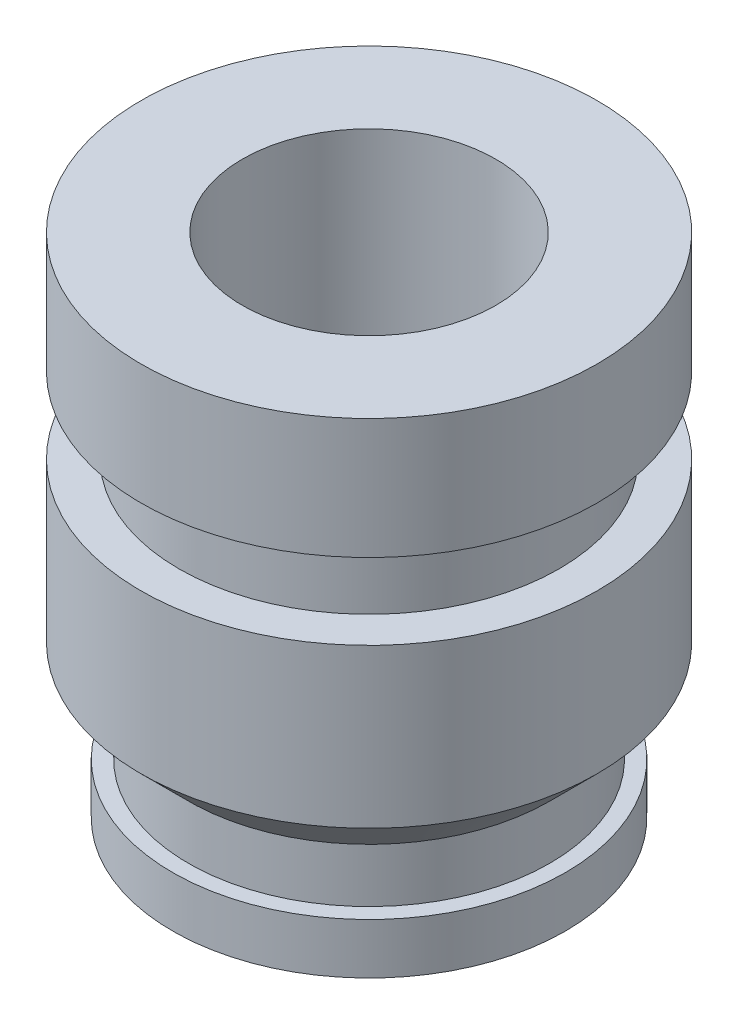
ISO-10303-21;
HEADER;
FILE_DESCRIPTION(('STEP AP214'),'2;1');
FILE_NAME('part.step','',(''),(''),'','','');
FILE_SCHEMA(('AUTOMOTIVE_DESIGN { 1 0 10303 214 1 1 1 1 }'));
ENDSEC;
DATA;
#1=APPLICATION_CONTEXT('core data for automotive mechanical design processes');
#2=APPLICATION_PROTOCOL_DEFINITION('international standard','automotive_design',2000,#1);
#3=PRODUCT_CONTEXT('',#1,'mechanical');
#4=PRODUCT('Part','Part','',(#3));
#5=PRODUCT_RELATED_PRODUCT_CATEGORY('part','',(#4));
#6=PRODUCT_DEFINITION_FORMATION('','',#4);
#7=PRODUCT_DEFINITION_CONTEXT('part definition',#1,'design');
#8=PRODUCT_DEFINITION('design','',#6,#7);
#9=PRODUCT_DEFINITION_SHAPE('','',#8);
#10=(LENGTH_UNIT() NAMED_UNIT(*) SI_UNIT(.MILLI.,.METRE.));
#11=(NAMED_UNIT(*) PLANE_ANGLE_UNIT() SI_UNIT($,.RADIAN.));
#12=(NAMED_UNIT(*) SI_UNIT($,.STERADIAN.) SOLID_ANGLE_UNIT());
#13=UNCERTAINTY_MEASURE_WITH_UNIT(LENGTH_MEASURE(1.E-05),#10,'distance_accuracy_value','');
#14=(GEOMETRIC_REPRESENTATION_CONTEXT(3) GLOBAL_UNCERTAINTY_ASSIGNED_CONTEXT((#13)) GLOBAL_UNIT_ASSIGNED_CONTEXT((#10,
#11,#12)) REPRESENTATION_CONTEXT('',''));
#15=CARTESIAN_POINT('',(0.,0.,0.));
#16=DIRECTION('',(0.,0.,1.));
#17=DIRECTION('',(1.,0.,0.));
#18=AXIS2_PLACEMENT_3D('',#15,#16,#17);
#19=CARTESIAN_POINT('',(1.55,0.,0.));
#20=DIRECTION('',(0.,-1.,0.));
#21=DIRECTION('',(1.,0.,0.));
#22=AXIS2_PLACEMENT_3D('',#19,#20,#21);
#23=PLANE('',#22);
#24=CARTESIAN_POINT('',(0.,0.,0.));
#25=DIRECTION('',(0.,-1.,0.));
#26=DIRECTION('',(1.,0.,0.));
#27=AXIS2_PLACEMENT_3D('',#24,#25,#26);
#28=CIRCLE('',#27,1.55);
#29=CARTESIAN_POINT('',(1.55,0.,0.));
#30=VERTEX_POINT('',#29);
#31=EDGE_CURVE('E92',#30,#30,#28,.T.);
#32=ORIENTED_EDGE('',*,*,#31,.T.);
#33=EDGE_LOOP('',(#32));
#34=FACE_BOUND('',#33,.T.);
#35=CARTESIAN_POINT('',(0.,0.,0.));
#36=DIRECTION('',(0.,-1.,0.));
#37=DIRECTION('',(1.,0.,0.));
#38=AXIS2_PLACEMENT_3D('',#35,#36,#37);
#39=CIRCLE('',#38,1.);
#40=CARTESIAN_POINT('',(1.,0.,0.));
#41=VERTEX_POINT('',#40);
#42=EDGE_CURVE('E10',#41,#41,#39,.T.);
#43=ORIENTED_EDGE('',*,*,#42,.F.);
#44=EDGE_LOOP('',(#43));
#45=FACE_BOUND('',#44,.T.);
#46=ADVANCED_FACE('F41',(#34,#45),#23,.T.);
#47=CARTESIAN_POINT('',(3.43024899888577E-12,-1000.,0.));
#48=DIRECTION('',(0.,-1.,0.));
#49=DIRECTION('',(1.,0.,0.));
#50=AXIS2_PLACEMENT_3D('',#47,#48,#49);
#51=CYLINDRICAL_SURFACE('',#50,1.00000000000001);
#52=ORIENTED_EDGE('',*,*,#42,.T.);
#53=EDGE_LOOP('',(#52));
#54=FACE_BOUND('',#53,.T.);
#55=CARTESIAN_POINT('',(0.,4.,0.));
#56=DIRECTION('',(0.,-1.,0.));
#57=DIRECTION('',(1.,0.,0.));
#58=AXIS2_PLACEMENT_3D('',#55,#56,#57);
#59=CIRCLE('',#58,1.00000000000001);
#60=CARTESIAN_POINT('',(1.,4.00000000000001,0.));
#61=VERTEX_POINT('',#60);
#62=EDGE_CURVE('E48',#61,#61,#59,.T.);
#63=ORIENTED_EDGE('',*,*,#62,.F.);
#64=EDGE_LOOP('',(#63));
#65=FACE_BOUND('',#64,.T.);
#66=ADVANCED_FACE('F111',(#54,#65),#51,.F.);
#67=CARTESIAN_POINT('',(1.,4.,0.));
#68=DIRECTION('',(0.,1.,0.));
#69=DIRECTION('',(-1.,0.,0.));
#70=AXIS2_PLACEMENT_3D('',#67,#68,#69);
#71=PLANE('',#70);
#72=ORIENTED_EDGE('',*,*,#62,.T.);
#73=EDGE_LOOP('',(#72));
#74=FACE_BOUND('',#73,.T.);
#75=CARTESIAN_POINT('',(0.,4.,0.));
#76=DIRECTION('',(0.,-1.,0.));
#77=DIRECTION('',(1.,0.,0.));
#78=AXIS2_PLACEMENT_3D('',#75,#76,#77);
#79=CIRCLE('',#78,1.80000000000001);
#80=CARTESIAN_POINT('',(1.8,4.00000000000001,0.));
#81=VERTEX_POINT('',#80);
#82=EDGE_CURVE('E53',#81,#81,#79,.T.);
#83=ORIENTED_EDGE('',*,*,#82,.F.);
#84=EDGE_LOOP('',(#83));
#85=FACE_BOUND('',#84,.T.);
#86=ADVANCED_FACE('F115',(#74,#85),#71,.T.);
#87=CARTESIAN_POINT('',(3.43024899888577E-12,-1000.,0.));
#88=DIRECTION('',(0.,-1.,0.));
#89=DIRECTION('',(1.,0.,0.));
#90=AXIS2_PLACEMENT_3D('',#87,#88,#89);
#91=CYLINDRICAL_SURFACE('',#90,1.80000000000001);
#92=ORIENTED_EDGE('',*,*,#82,.T.);
#93=EDGE_LOOP('',(#92));
#94=FACE_BOUND('',#93,.T.);
#95=CARTESIAN_POINT('',(0.,3.05,0.));
#96=DIRECTION('',(0.,-1.,0.));
#97=DIRECTION('',(1.,0.,0.));
#98=AXIS2_PLACEMENT_3D('',#95,#96,#97);
#99=CIRCLE('',#98,1.80000000000001);
#100=CARTESIAN_POINT('',(1.8,3.05,0.));
#101=VERTEX_POINT('',#100);
#102=EDGE_CURVE('E58',#101,#101,#99,.T.);
#103=ORIENTED_EDGE('',*,*,#102,.F.);
#104=EDGE_LOOP('',(#103));
#105=FACE_BOUND('',#104,.T.);
#106=ADVANCED_FACE('F119',(#94,#105),#91,.T.);
#107=CARTESIAN_POINT('',(1.8,3.05,0.));
#108=DIRECTION('',(0.,-1.,0.));
#109=DIRECTION('',(1.,0.,0.));
#110=AXIS2_PLACEMENT_3D('',#107,#108,#109);
#111=PLANE('',#110);
#112=ORIENTED_EDGE('',*,*,#102,.T.);
#113=EDGE_LOOP('',(#112));
#114=FACE_BOUND('',#113,.T.);
#115=CARTESIAN_POINT('',(0.,3.05,0.));
#116=DIRECTION('',(0.,-1.,0.));
#117=DIRECTION('',(1.,0.,0.));
#118=AXIS2_PLACEMENT_3D('',#115,#116,#117);
#119=CIRCLE('',#118,1.50000000000001);
#120=CARTESIAN_POINT('',(1.5,3.05,0.));
#121=VERTEX_POINT('',#120);
#122=EDGE_CURVE('E64',#121,#121,#119,.T.);
#123=ORIENTED_EDGE('',*,*,#122,.F.);
#124=EDGE_LOOP('',(#123));
#125=FACE_BOUND('',#124,.T.);
#126=ADVANCED_FACE('F125',(#114,#125),#111,.T.);
#127=CARTESIAN_POINT('',(3.43024899888577E-12,-1000.,0.));
#128=DIRECTION('',(0.,-1.,0.));
#129=DIRECTION('',(1.,0.,0.));
#130=AXIS2_PLACEMENT_3D('',#127,#128,#129);
#131=CYLINDRICAL_SURFACE('',#130,1.50000000000001);
#132=ORIENTED_EDGE('',*,*,#122,.T.);
#133=EDGE_LOOP('',(#132));
#134=FACE_BOUND('',#133,.T.);
#135=CARTESIAN_POINT('',(0.,2.45000000000006,0.));
#136=DIRECTION('',(0.,-1.,0.));
#137=DIRECTION('',(1.,0.,0.));
#138=AXIS2_PLACEMENT_3D('',#135,#136,#137);
#139=CIRCLE('',#138,1.50000000000001);
#140=CARTESIAN_POINT('',(1.5,2.45000000000007,0.));
#141=VERTEX_POINT('',#140);
#142=EDGE_CURVE('E68',#141,#141,#139,.T.);
#143=ORIENTED_EDGE('',*,*,#142,.F.);
#144=EDGE_LOOP('',(#143));
#145=FACE_BOUND('',#144,.T.);
#146=ADVANCED_FACE('F129',(#134,#145),#131,.T.);
#147=CARTESIAN_POINT('',(1.5,2.45,0.));
#148=DIRECTION('',(0.,1.,0.));
#149=DIRECTION('',(-1.,0.,0.));
#150=AXIS2_PLACEMENT_3D('',#147,#148,#149);
#151=PLANE('',#150);
#152=ORIENTED_EDGE('',*,*,#142,.T.);
#153=EDGE_LOOP('',(#152));
#154=FACE_BOUND('',#153,.T.);
#155=CARTESIAN_POINT('',(0.,2.45000000000006,0.));
#156=DIRECTION('',(0.,-1.,0.));
#157=DIRECTION('',(1.,0.,0.));
#158=AXIS2_PLACEMENT_3D('',#155,#156,#157);
#159=CIRCLE('',#158,1.80000000000001);
#160=CARTESIAN_POINT('',(1.8,2.45000000000007,0.));
#161=VERTEX_POINT('',#160);
#162=EDGE_CURVE('E72',#161,#161,#159,.T.);
#163=ORIENTED_EDGE('',*,*,#162,.F.);
#164=EDGE_LOOP('',(#163));
#165=FACE_BOUND('',#164,.T.);
#166=ADVANCED_FACE('F133',(#154,#165),#151,.T.);
#167=CARTESIAN_POINT('',(3.43024899888577E-12,-1000.,0.));
#168=DIRECTION('',(0.,-1.,0.));
#169=DIRECTION('',(1.,0.,0.));
#170=AXIS2_PLACEMENT_3D('',#167,#168,#169);
#171=CYLINDRICAL_SURFACE('',#170,1.80000000000001);
#172=ORIENTED_EDGE('',*,*,#162,.T.);
#173=EDGE_LOOP('',(#172));
#174=FACE_BOUND('',#173,.T.);
#175=CARTESIAN_POINT('',(0.,1.20000000000009,0.));
#176=DIRECTION('',(0.,-1.,0.));
#177=DIRECTION('',(1.,0.,0.));
#178=AXIS2_PLACEMENT_3D('',#175,#176,#177);
#179=CIRCLE('',#178,1.8);
#180=CARTESIAN_POINT('',(1.8,1.2000000000001,0.));
#181=VERTEX_POINT('',#180);
#182=EDGE_CURVE('E76',#181,#181,#179,.T.);
#183=ORIENTED_EDGE('',*,*,#182,.F.);
#184=EDGE_LOOP('',(#183));
#185=FACE_BOUND('',#184,.T.);
#186=ADVANCED_FACE('F137',(#174,#185),#171,.T.);
#187=CARTESIAN_POINT('',(0.,0.825000000000076,0.));
#188=DIRECTION('',(0.,1.,0.));
#189=DIRECTION('',(-1.,0.,0.));
#190=AXIS2_PLACEMENT_3D('',#187,#188,#189);
#191=CONICAL_SURFACE('',#190,1.425,0.785398163397432);
#192=ORIENTED_EDGE('',*,*,#182,.T.);
#193=EDGE_LOOP('',(#192));
#194=FACE_BOUND('',#193,.T.);
#195=CARTESIAN_POINT('',(0.,0.825000000000076,0.));
#196=DIRECTION('',(0.,-1.,0.));
#197=DIRECTION('',(1.,0.,0.));
#198=AXIS2_PLACEMENT_3D('',#195,#196,#197);
#199=CIRCLE('',#198,1.425);
#200=CARTESIAN_POINT('',(1.425,0.825000000000081,0.));
#201=VERTEX_POINT('',#200);
#202=EDGE_CURVE('E80',#201,#201,#199,.T.);
#203=ORIENTED_EDGE('',*,*,#202,.F.);
#204=EDGE_LOOP('',(#203));
#205=FACE_BOUND('',#204,.T.);
#206=ADVANCED_FACE('F141',(#194,#205),#191,.T.);
#207=CARTESIAN_POINT('',(3.43024899888577E-12,-1000.,0.));
#208=DIRECTION('',(0.,-1.,0.));
#209=DIRECTION('',(1.,0.,0.));
#210=AXIS2_PLACEMENT_3D('',#207,#208,#209);
#211=CYLINDRICAL_SURFACE('',#210,1.425);
#212=ORIENTED_EDGE('',*,*,#202,.T.);
#213=EDGE_LOOP('',(#212));
#214=FACE_BOUND('',#213,.T.);
#215=CARTESIAN_POINT('',(0.,0.399999999999956,0.));
#216=DIRECTION('',(0.,-1.,0.));
#217=DIRECTION('',(1.,0.,0.));
#218=AXIS2_PLACEMENT_3D('',#215,#216,#217);
#219=CIRCLE('',#218,1.425);
#220=CARTESIAN_POINT('',(1.425,0.399999999999961,0.));
#221=VERTEX_POINT('',#220);
#222=EDGE_CURVE('E84',#221,#221,#219,.T.);
#223=ORIENTED_EDGE('',*,*,#222,.F.);
#224=EDGE_LOOP('',(#223));
#225=FACE_BOUND('',#224,.T.);
#226=ADVANCED_FACE('F107',(#214,#225),#211,.T.);
#227=CARTESIAN_POINT('',(1.425,0.4,0.));
#228=DIRECTION('',(0.,1.,0.));
#229=DIRECTION('',(-1.,0.,0.));
#230=AXIS2_PLACEMENT_3D('',#227,#228,#229);
#231=PLANE('',#230);
#232=ORIENTED_EDGE('',*,*,#222,.T.);
#233=EDGE_LOOP('',(#232));
#234=FACE_BOUND('',#233,.T.);
#235=CARTESIAN_POINT('',(0.,0.399999999999956,0.));
#236=DIRECTION('',(0.,-1.,0.));
#237=DIRECTION('',(1.,0.,0.));
#238=AXIS2_PLACEMENT_3D('',#235,#236,#237);
#239=CIRCLE('',#238,1.55);
#240=CARTESIAN_POINT('',(1.55,0.399999999999961,0.));
#241=VERTEX_POINT('',#240);
#242=EDGE_CURVE('E88',#241,#241,#239,.T.);
#243=ORIENTED_EDGE('',*,*,#242,.F.);
#244=EDGE_LOOP('',(#243));
#245=FACE_BOUND('',#244,.T.);
#246=ADVANCED_FACE('F101',(#234,#245),#231,.T.);
#247=CARTESIAN_POINT('',(3.43024899888577E-12,-1000.,0.));
#248=DIRECTION('',(0.,-1.,0.));
#249=DIRECTION('',(1.,0.,0.));
#250=AXIS2_PLACEMENT_3D('',#247,#248,#249);
#251=CYLINDRICAL_SURFACE('',#250,1.55);
#252=ORIENTED_EDGE('',*,*,#242,.T.);
#253=EDGE_LOOP('',(#252));
#254=FACE_BOUND('',#253,.T.);
#255=ORIENTED_EDGE('',*,*,#31,.F.);
#256=EDGE_LOOP('',(#255));
#257=FACE_BOUND('',#256,.T.);
#258=ADVANCED_FACE('F99',(#254,#257),#251,.T.);
#259=CLOSED_SHELL('',(#46,#66,#86,#106,#126,#146,#166,#186,#206,#226,#246,#258));
#260=MANIFOLD_SOLID_BREP('B2',#259);
#261=ADVANCED_BREP_SHAPE_REPRESENTATION('',(#18,#260),#14);
#262=SHAPE_DEFINITION_REPRESENTATION(#9,#261);
ENDSEC;
END-ISO-10303-21;
